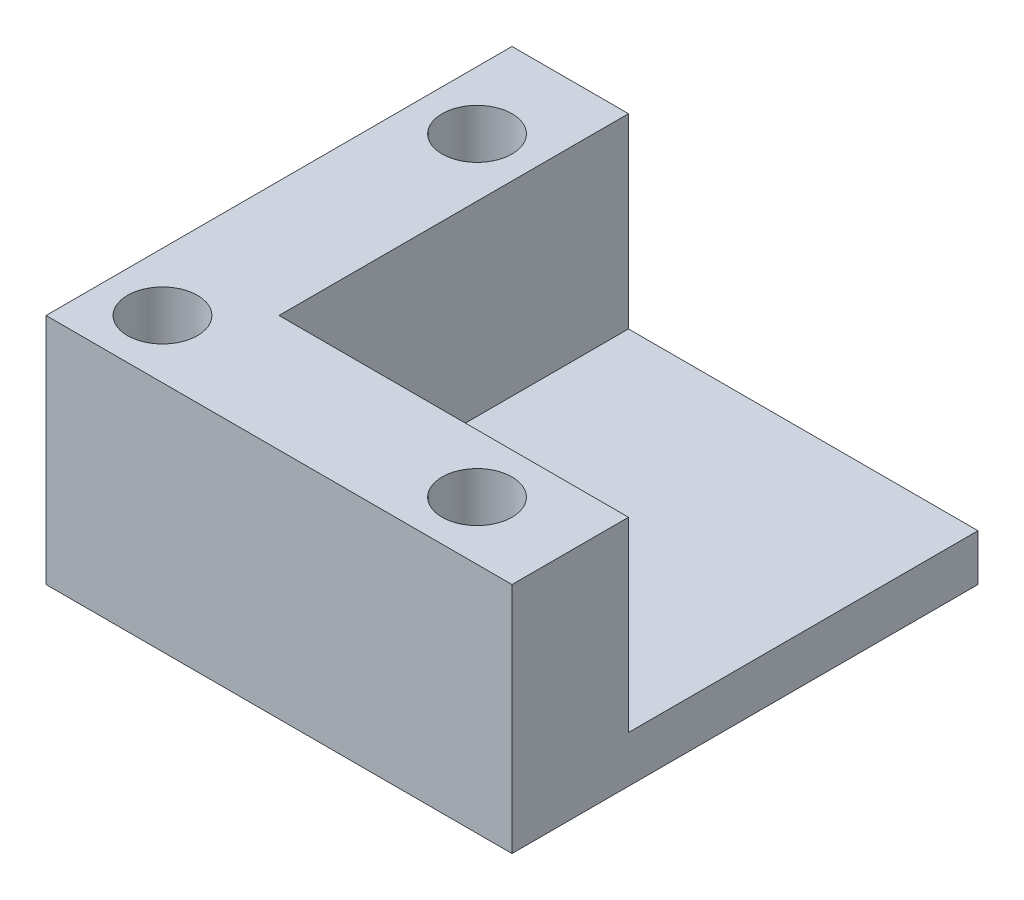
ISO-10303-21;
HEADER;
FILE_DESCRIPTION(('STEP AP214'),'2;1');
FILE_NAME('part.step','',(''),(''),'','','');
FILE_SCHEMA(('AUTOMOTIVE_DESIGN { 1 0 10303 214 1 1 1 1 }'));
ENDSEC;
DATA;
#1=APPLICATION_CONTEXT('core data for automotive mechanical design processes');
#2=APPLICATION_PROTOCOL_DEFINITION('international standard','automotive_design',2000,#1);
#3=PRODUCT_CONTEXT('',#1,'mechanical');
#4=PRODUCT('Part','Part','',(#3));
#5=PRODUCT_RELATED_PRODUCT_CATEGORY('part','',(#4));
#6=PRODUCT_DEFINITION_FORMATION('','',#4);
#7=PRODUCT_DEFINITION_CONTEXT('part definition',#1,'design');
#8=PRODUCT_DEFINITION('design','',#6,#7);
#9=PRODUCT_DEFINITION_SHAPE('','',#8);
#10=(LENGTH_UNIT() NAMED_UNIT(*) SI_UNIT(.MILLI.,.METRE.));
#11=(NAMED_UNIT(*) PLANE_ANGLE_UNIT() SI_UNIT($,.RADIAN.));
#12=(NAMED_UNIT(*) SI_UNIT($,.STERADIAN.) SOLID_ANGLE_UNIT());
#13=UNCERTAINTY_MEASURE_WITH_UNIT(LENGTH_MEASURE(1.E-05),#10,'distance_accuracy_value','');
#14=(GEOMETRIC_REPRESENTATION_CONTEXT(3) GLOBAL_UNCERTAINTY_ASSIGNED_CONTEXT((#13)) GLOBAL_UNIT_ASSIGNED_CONTEXT((#10,
#11,#12)) REPRESENTATION_CONTEXT('',''));
#15=CARTESIAN_POINT('',(0.,0.,0.));
#16=DIRECTION('',(0.,0.,1.));
#17=DIRECTION('',(1.,0.,0.));
#18=AXIS2_PLACEMENT_3D('',#15,#16,#17);
#19=CARTESIAN_POINT('',(0.,2.54,0.));
#20=DIRECTION('',(0.,-1.,0.));
#21=DIRECTION('',(0.,0.,-1.));
#22=AXIS2_PLACEMENT_3D('',#19,#20,#21);
#23=PLANE('',#22);
#24=DIRECTION('',(0.,0.,-1.));
#25=VECTOR('',#24,1.);
#26=CARTESIAN_POINT('',(6.35,2.54,-25.4));
#27=LINE('',#26,#25);
#28=CARTESIAN_POINT('',(6.35,2.54,-6.35));
#29=VERTEX_POINT('',#28);
#30=CARTESIAN_POINT('',(6.35,2.54,-25.4));
#31=VERTEX_POINT('',#30);
#32=EDGE_CURVE('E126',#29,#31,#27,.T.);
#33=ORIENTED_EDGE('',*,*,#32,.F.);
#34=DIRECTION('',(-1.,0.,0.));
#35=VECTOR('',#34,1.);
#36=CARTESIAN_POINT('',(6.35,2.54,-6.35));
#37=LINE('',#36,#35);
#38=CARTESIAN_POINT('',(25.4,2.54,-6.35));
#39=VERTEX_POINT('',#38);
#40=EDGE_CURVE('E60',#39,#29,#37,.T.);
#41=ORIENTED_EDGE('',*,*,#40,.F.);
#42=DIRECTION('',(0.,0.,-1.));
#43=VECTOR('',#42,1.);
#44=CARTESIAN_POINT('',(25.4,2.54,0.));
#45=LINE('',#44,#43);
#46=CARTESIAN_POINT('',(25.4,2.54,-25.4));
#47=VERTEX_POINT('',#46);
#48=EDGE_CURVE('E159',#39,#47,#45,.T.);
#49=ORIENTED_EDGE('',*,*,#48,.T.);
#50=DIRECTION('',(-1.,0.,0.));
#51=VECTOR('',#50,1.);
#52=CARTESIAN_POINT('',(0.,2.54,-25.4));
#53=LINE('',#52,#51);
#54=EDGE_CURVE('E55',#47,#31,#53,.T.);
#55=ORIENTED_EDGE('',*,*,#54,.T.);
#56=EDGE_LOOP('',(#33,#41,#49,#55));
#57=FACE_BOUND('',#56,.T.);
#58=ADVANCED_FACE('F39',(#57),#23,.F.);
#59=CARTESIAN_POINT('',(0.,2.54,0.));
#60=DIRECTION('',(1.,0.,0.));
#61=DIRECTION('',(0.,0.,-1.));
#62=AXIS2_PLACEMENT_3D('',#59,#60,#61);
#63=PLANE('',#62);
#64=DIRECTION('',(0.,0.,1.));
#65=VECTOR('',#64,1.);
#66=CARTESIAN_POINT('',(0.,0.,0.));
#67=LINE('',#66,#65);
#68=CARTESIAN_POINT('',(0.,0.,-25.4));
#69=VERTEX_POINT('',#68);
#70=CARTESIAN_POINT('',(0.,0.,0.));
#71=VERTEX_POINT('',#70);
#72=EDGE_CURVE('E158',#69,#71,#67,.T.);
#73=ORIENTED_EDGE('',*,*,#72,.T.);
#74=DIRECTION('',(0.,-1.,0.));
#75=VECTOR('',#74,1.);
#76=CARTESIAN_POINT('',(0.,2.54,0.));
#77=LINE('',#76,#75);
#78=CARTESIAN_POINT('',(0.,12.7,0.));
#79=VERTEX_POINT('',#78);
#80=EDGE_CURVE('E11',#79,#71,#77,.T.);
#81=ORIENTED_EDGE('',*,*,#80,.F.);
#82=DIRECTION('',(0.,0.,1.));
#83=VECTOR('',#82,1.);
#84=CARTESIAN_POINT('',(0.,12.7,-25.4));
#85=LINE('',#84,#83);
#86=CARTESIAN_POINT('',(0.,12.7,-25.4));
#87=VERTEX_POINT('',#86);
#88=EDGE_CURVE('E114',#87,#79,#85,.T.);
#89=ORIENTED_EDGE('',*,*,#88,.F.);
#90=DIRECTION('',(0.,-1.,0.));
#91=VECTOR('',#90,1.);
#92=CARTESIAN_POINT('',(0.,2.54,-25.4));
#93=LINE('',#92,#91);
#94=EDGE_CURVE('E98',#87,#69,#93,.T.);
#95=ORIENTED_EDGE('',*,*,#94,.T.);
#96=EDGE_LOOP('',(#73,#81,#89,#95));
#97=FACE_BOUND('',#96,.T.);
#98=ADVANCED_FACE('F41',(#97),#63,.F.);
#99=CARTESIAN_POINT('',(0.,2.54,0.));
#100=DIRECTION('',(0.,0.,-1.));
#101=DIRECTION('',(-1.,0.,0.));
#102=AXIS2_PLACEMENT_3D('',#99,#100,#101);
#103=PLANE('',#102);
#104=DIRECTION('',(1.,0.,0.));
#105=VECTOR('',#104,1.);
#106=CARTESIAN_POINT('',(0.,0.,0.));
#107=LINE('',#106,#105);
#108=CARTESIAN_POINT('',(25.4,0.,0.));
#109=VERTEX_POINT('',#108);
#110=EDGE_CURVE('E166',#71,#109,#107,.T.);
#111=ORIENTED_EDGE('',*,*,#110,.T.);
#112=DIRECTION('',(0.,-1.,0.));
#113=VECTOR('',#112,1.);
#114=CARTESIAN_POINT('',(25.4,2.54,0.));
#115=LINE('',#114,#113);
#116=CARTESIAN_POINT('',(25.4,12.7,0.));
#117=VERTEX_POINT('',#116);
#118=EDGE_CURVE('E48',#117,#109,#115,.T.);
#119=ORIENTED_EDGE('',*,*,#118,.F.);
#120=DIRECTION('',(1.,0.,0.));
#121=VECTOR('',#120,1.);
#122=CARTESIAN_POINT('',(0.,12.7,0.));
#123=LINE('',#122,#121);
#124=EDGE_CURVE('E119',#79,#117,#123,.T.);
#125=ORIENTED_EDGE('',*,*,#124,.F.);
#126=ORIENTED_EDGE('',*,*,#80,.T.);
#127=EDGE_LOOP('',(#111,#119,#125,#126));
#128=FACE_BOUND('',#127,.T.);
#129=ADVANCED_FACE('F186',(#128),#103,.F.);
#130=CARTESIAN_POINT('',(25.4,2.54,0.));
#131=DIRECTION('',(-1.,0.,0.));
#132=DIRECTION('',(0.,0.,1.));
#133=AXIS2_PLACEMENT_3D('',#130,#131,#132);
#134=PLANE('',#133);
#135=DIRECTION('',(0.,0.,-1.));
#136=VECTOR('',#135,1.);
#137=CARTESIAN_POINT('',(25.4,0.,0.));
#138=LINE('',#137,#136);
#139=CARTESIAN_POINT('',(25.4,0.,-25.4));
#140=VERTEX_POINT('',#139);
#141=EDGE_CURVE('E169',#109,#140,#138,.T.);
#142=ORIENTED_EDGE('',*,*,#141,.T.);
#143=DIRECTION('',(0.,-1.,0.));
#144=VECTOR('',#143,1.);
#145=CARTESIAN_POINT('',(25.4,2.54,-25.4));
#146=LINE('',#145,#144);
#147=EDGE_CURVE('E111',#47,#140,#146,.T.);
#148=ORIENTED_EDGE('',*,*,#147,.F.);
#149=ORIENTED_EDGE('',*,*,#48,.F.);
#150=DIRECTION('',(0.,-1.,0.));
#151=VECTOR('',#150,1.);
#152=CARTESIAN_POINT('',(25.4,12.7,-6.35));
#153=LINE('',#152,#151);
#154=CARTESIAN_POINT('',(25.4,12.7,-6.35));
#155=VERTEX_POINT('',#154);
#156=EDGE_CURVE('E154',#155,#39,#153,.T.);
#157=ORIENTED_EDGE('',*,*,#156,.F.);
#158=DIRECTION('',(0.,0.,-1.));
#159=VECTOR('',#158,1.);
#160=CARTESIAN_POINT('',(25.4,12.7,0.));
#161=LINE('',#160,#159);
#162=EDGE_CURVE('E136',#117,#155,#161,.T.);
#163=ORIENTED_EDGE('',*,*,#162,.F.);
#164=ORIENTED_EDGE('',*,*,#118,.T.);
#165=EDGE_LOOP('',(#142,#148,#149,#157,#163,#164));
#166=FACE_BOUND('',#165,.T.);
#167=ADVANCED_FACE('F180',(#166),#134,.F.);
#168=CARTESIAN_POINT('',(0.,2.54,-25.4));
#169=DIRECTION('',(0.,0.,1.));
#170=DIRECTION('',(1.,0.,0.));
#171=AXIS2_PLACEMENT_3D('',#168,#169,#170);
#172=PLANE('',#171);
#173=DIRECTION('',(-1.,0.,0.));
#174=VECTOR('',#173,1.);
#175=CARTESIAN_POINT('',(0.,0.,-25.4));
#176=LINE('',#175,#174);
#177=EDGE_CURVE('E106',#140,#69,#176,.T.);
#178=ORIENTED_EDGE('',*,*,#177,.T.);
#179=ORIENTED_EDGE('',*,*,#94,.F.);
#180=DIRECTION('',(-1.,0.,0.));
#181=VECTOR('',#180,1.);
#182=CARTESIAN_POINT('',(0.,12.7,-25.4));
#183=LINE('',#182,#181);
#184=CARTESIAN_POINT('',(6.35,12.7,-25.4));
#185=VERTEX_POINT('',#184);
#186=EDGE_CURVE('E103',#185,#87,#183,.T.);
#187=ORIENTED_EDGE('',*,*,#186,.F.);
#188=DIRECTION('',(0.,-1.,0.));
#189=VECTOR('',#188,1.);
#190=CARTESIAN_POINT('',(6.35,12.7,-25.4));
#191=LINE('',#190,#189);
#192=EDGE_CURVE('E144',#185,#31,#191,.T.);
#193=ORIENTED_EDGE('',*,*,#192,.T.);
#194=ORIENTED_EDGE('',*,*,#54,.F.);
#195=ORIENTED_EDGE('',*,*,#147,.T.);
#196=EDGE_LOOP('',(#178,#179,#187,#193,#194,#195));
#197=FACE_BOUND('',#196,.T.);
#198=ADVANCED_FACE('F100',(#197),#172,.F.);
#199=CARTESIAN_POINT('',(0.,0.,0.));
#200=DIRECTION('',(0.,-1.,0.));
#201=DIRECTION('',(0.,0.,-1.));
#202=AXIS2_PLACEMENT_3D('',#199,#200,#201);
#203=PLANE('',#202);
#204=ORIENTED_EDGE('',*,*,#72,.F.);
#205=ORIENTED_EDGE('',*,*,#177,.F.);
#206=ORIENTED_EDGE('',*,*,#141,.F.);
#207=ORIENTED_EDGE('',*,*,#110,.F.);
#208=EDGE_LOOP('',(#204,#205,#206,#207));
#209=FACE_BOUND('',#208,.T.);
#210=ADVANCED_FACE('F185',(#209),#203,.T.);
#211=CARTESIAN_POINT('',(6.35,12.7,-6.35));
#212=DIRECTION('',(0.,0.,1.));
#213=DIRECTION('',(1.,0.,0.));
#214=AXIS2_PLACEMENT_3D('',#211,#212,#213);
#215=PLANE('',#214);
#216=ORIENTED_EDGE('',*,*,#40,.T.);
#217=DIRECTION('',(0.,-1.,0.));
#218=VECTOR('',#217,1.);
#219=CARTESIAN_POINT('',(6.35,12.7,-6.35));
#220=LINE('',#219,#218);
#221=CARTESIAN_POINT('',(6.35,12.7,-6.35));
#222=VERTEX_POINT('',#221);
#223=EDGE_CURVE('E150',#222,#29,#220,.T.);
#224=ORIENTED_EDGE('',*,*,#223,.F.);
#225=DIRECTION('',(-1.,0.,0.));
#226=VECTOR('',#225,1.);
#227=CARTESIAN_POINT('',(6.35,12.7,-6.35));
#228=LINE('',#227,#226);
#229=EDGE_CURVE('E139',#155,#222,#228,.T.);
#230=ORIENTED_EDGE('',*,*,#229,.F.);
#231=ORIENTED_EDGE('',*,*,#156,.T.);
#232=EDGE_LOOP('',(#216,#224,#230,#231));
#233=FACE_BOUND('',#232,.T.);
#234=ADVANCED_FACE('F190',(#233),#215,.F.);
#235=CARTESIAN_POINT('',(6.35,12.7,-25.4));
#236=DIRECTION('',(-1.,0.,0.));
#237=DIRECTION('',(0.,0.,1.));
#238=AXIS2_PLACEMENT_3D('',#235,#236,#237);
#239=PLANE('',#238);
#240=ORIENTED_EDGE('',*,*,#32,.T.);
#241=ORIENTED_EDGE('',*,*,#192,.F.);
#242=DIRECTION('',(0.,0.,-1.));
#243=VECTOR('',#242,1.);
#244=CARTESIAN_POINT('',(6.35,12.7,-25.4));
#245=LINE('',#244,#243);
#246=EDGE_CURVE('E123',#222,#185,#245,.T.);
#247=ORIENTED_EDGE('',*,*,#246,.F.);
#248=ORIENTED_EDGE('',*,*,#223,.T.);
#249=EDGE_LOOP('',(#240,#241,#247,#248));
#250=FACE_BOUND('',#249,.T.);
#251=ADVANCED_FACE('F192',(#250),#239,.F.);
#252=CARTESIAN_POINT('',(0.,12.7,0.));
#253=DIRECTION('',(0.,-1.,0.));
#254=DIRECTION('',(0.,0.,-1.));
#255=AXIS2_PLACEMENT_3D('',#252,#253,#254);
#256=PLANE('',#255);
#257=CARTESIAN_POINT('',(3.175,12.7,-20.32));
#258=DIRECTION('',(0.,1.,0.));
#259=DIRECTION('',(0.,0.,1.));
#260=AXIS2_PLACEMENT_3D('',#257,#258,#259);
#261=CIRCLE('',#260,1.905);
#262=CARTESIAN_POINT('',(3.175,12.7,-18.415));
#263=VERTEX_POINT('',#262);
#264=EDGE_CURVE('E339',#263,#263,#261,.T.);
#265=ORIENTED_EDGE('',*,*,#264,.F.);
#266=EDGE_LOOP('',(#265));
#267=FACE_BOUND('',#266,.T.);
#268=CARTESIAN_POINT('',(3.175,12.7,-3.175));
#269=DIRECTION('',(0.,1.,0.));
#270=DIRECTION('',(0.,0.,1.));
#271=AXIS2_PLACEMENT_3D('',#268,#269,#270);
#272=CIRCLE('',#271,1.905);
#273=CARTESIAN_POINT('',(3.175,12.7,-1.27));
#274=VERTEX_POINT('',#273);
#275=EDGE_CURVE('E349',#274,#274,#272,.T.);
#276=ORIENTED_EDGE('',*,*,#275,.F.);
#277=EDGE_LOOP('',(#276));
#278=FACE_BOUND('',#277,.T.);
#279=CARTESIAN_POINT('',(20.32,12.7,-3.175));
#280=DIRECTION('',(0.,1.,0.));
#281=DIRECTION('',(0.,0.,1.));
#282=AXIS2_PLACEMENT_3D('',#279,#280,#281);
#283=CIRCLE('',#282,1.905);
#284=CARTESIAN_POINT('',(20.32,12.7,-1.27));
#285=VERTEX_POINT('',#284);
#286=EDGE_CURVE('E131',#285,#285,#283,.T.);
#287=ORIENTED_EDGE('',*,*,#286,.F.);
#288=EDGE_LOOP('',(#287));
#289=FACE_BOUND('',#288,.T.);
#290=ORIENTED_EDGE('',*,*,#186,.T.);
#291=ORIENTED_EDGE('',*,*,#88,.T.);
#292=ORIENTED_EDGE('',*,*,#124,.T.);
#293=ORIENTED_EDGE('',*,*,#162,.T.);
#294=ORIENTED_EDGE('',*,*,#229,.T.);
#295=ORIENTED_EDGE('',*,*,#246,.T.);
#296=EDGE_LOOP('',(#290,#291,#292,#293,#294,#295));
#297=FACE_BOUND('',#296,.T.);
#298=ADVANCED_FACE('F121',(#267,#278,#289,#297),#256,.F.);
#299=CARTESIAN_POINT('',(20.32,6.35,-3.175));
#300=DIRECTION('',(0.,1.,0.));
#301=DIRECTION('',(0.,0.,1.));
#302=AXIS2_PLACEMENT_3D('',#299,#300,#301);
#303=CYLINDRICAL_SURFACE('',#302,1.905);
#304=CARTESIAN_POINT('',(20.32,6.35,-3.175));
#305=DIRECTION('',(0.,1.,0.));
#306=DIRECTION('',(0.,0.,1.));
#307=AXIS2_PLACEMENT_3D('',#304,#305,#306);
#308=CIRCLE('',#307,1.905);
#309=CARTESIAN_POINT('',(20.32,6.35,-1.27));
#310=VERTEX_POINT('',#309);
#311=EDGE_CURVE('E352',#310,#310,#308,.T.);
#312=ORIENTED_EDGE('',*,*,#311,.F.);
#313=EDGE_LOOP('',(#312));
#314=FACE_BOUND('',#313,.T.);
#315=ORIENTED_EDGE('',*,*,#286,.T.);
#316=EDGE_LOOP('',(#315));
#317=FACE_BOUND('',#316,.T.);
#318=ADVANCED_FACE('F239',(#314,#317),#303,.F.);
#319=CARTESIAN_POINT('',(20.32,6.35,-3.175));
#320=DIRECTION('',(0.,1.,0.));
#321=DIRECTION('',(0.,0.,1.));
#322=AXIS2_PLACEMENT_3D('',#319,#320,#321);
#323=PLANE('',#322);
#324=ORIENTED_EDGE('',*,*,#311,.T.);
#325=EDGE_LOOP('',(#324));
#326=FACE_BOUND('',#325,.T.);
#327=ADVANCED_FACE('F247',(#326),#323,.T.);
#328=CARTESIAN_POINT('',(3.175,6.35,-3.175));
#329=DIRECTION('',(0.,1.,0.));
#330=DIRECTION('',(0.,0.,1.));
#331=AXIS2_PLACEMENT_3D('',#328,#329,#330);
#332=CYLINDRICAL_SURFACE('',#331,1.905);
#333=CARTESIAN_POINT('',(3.175,6.35,-3.175));
#334=DIRECTION('',(0.,1.,0.));
#335=DIRECTION('',(0.,0.,1.));
#336=AXIS2_PLACEMENT_3D('',#333,#334,#335);
#337=CIRCLE('',#336,1.905);
#338=CARTESIAN_POINT('',(3.175,6.35,-1.27));
#339=VERTEX_POINT('',#338);
#340=EDGE_CURVE('E343',#339,#339,#337,.T.);
#341=ORIENTED_EDGE('',*,*,#340,.F.);
#342=EDGE_LOOP('',(#341));
#343=FACE_BOUND('',#342,.T.);
#344=ORIENTED_EDGE('',*,*,#275,.T.);
#345=EDGE_LOOP('',(#344));
#346=FACE_BOUND('',#345,.T.);
#347=ADVANCED_FACE('F255',(#343,#346),#332,.F.);
#348=CARTESIAN_POINT('',(3.175,6.35,-3.175));
#349=DIRECTION('',(0.,1.,0.));
#350=DIRECTION('',(0.,0.,1.));
#351=AXIS2_PLACEMENT_3D('',#348,#349,#350);
#352=PLANE('',#351);
#353=ORIENTED_EDGE('',*,*,#340,.T.);
#354=EDGE_LOOP('',(#353));
#355=FACE_BOUND('',#354,.T.);
#356=ADVANCED_FACE('F263',(#355),#352,.T.);
#357=CARTESIAN_POINT('',(3.175,6.35,-20.32));
#358=DIRECTION('',(0.,1.,0.));
#359=DIRECTION('',(0.,0.,1.));
#360=AXIS2_PLACEMENT_3D('',#357,#358,#359);
#361=CYLINDRICAL_SURFACE('',#360,1.905);
#362=CARTESIAN_POINT('',(3.175,6.35,-20.32));
#363=DIRECTION('',(0.,1.,0.));
#364=DIRECTION('',(0.,0.,1.));
#365=AXIS2_PLACEMENT_3D('',#362,#363,#364);
#366=CIRCLE('',#365,1.905);
#367=CARTESIAN_POINT('',(3.175,6.35,-18.415));
#368=VERTEX_POINT('',#367);
#369=EDGE_CURVE('E146',#368,#368,#366,.T.);
#370=ORIENTED_EDGE('',*,*,#369,.F.);
#371=EDGE_LOOP('',(#370));
#372=FACE_BOUND('',#371,.T.);
#373=ORIENTED_EDGE('',*,*,#264,.T.);
#374=EDGE_LOOP('',(#373));
#375=FACE_BOUND('',#374,.T.);
#376=ADVANCED_FACE('F271',(#372,#375),#361,.F.);
#377=CARTESIAN_POINT('',(3.175,6.35,-20.32));
#378=DIRECTION('',(0.,1.,0.));
#379=DIRECTION('',(0.,0.,1.));
#380=AXIS2_PLACEMENT_3D('',#377,#378,#379);
#381=PLANE('',#380);
#382=ORIENTED_EDGE('',*,*,#369,.T.);
#383=EDGE_LOOP('',(#382));
#384=FACE_BOUND('',#383,.T.);
#385=ADVANCED_FACE('F279',(#384),#381,.T.);
#386=CLOSED_SHELL('',(#58,#98,#129,#167,#198,#210,#234,#251,#298,#318,#327,#347,#356,#376,#385));
#387=MANIFOLD_SOLID_BREP('B2',#386);
#388=ADVANCED_BREP_SHAPE_REPRESENTATION('',(#18,#387),#14);
#389=SHAPE_DEFINITION_REPRESENTATION(#9,#388);
ENDSEC;
END-ISO-10303-21;
